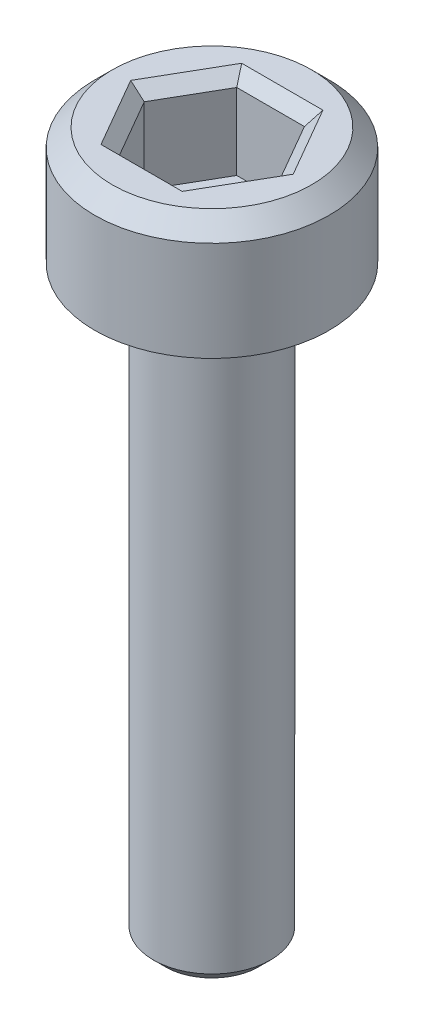
ISO-10303-21;
HEADER;
FILE_DESCRIPTION(('STEP AP214'),'2;1');
FILE_NAME('part.step','',(''),(''),'','','');
FILE_SCHEMA(('AUTOMOTIVE_DESIGN { 1 0 10303 214 1 1 1 1 }'));
ENDSEC;
DATA;
#1=APPLICATION_CONTEXT('core data for automotive mechanical design processes');
#2=APPLICATION_PROTOCOL_DEFINITION('international standard','automotive_design',2000,#1);
#3=PRODUCT_CONTEXT('',#1,'mechanical');
#4=PRODUCT('Part','Part','',(#3));
#5=PRODUCT_RELATED_PRODUCT_CATEGORY('part','',(#4));
#6=PRODUCT_DEFINITION_FORMATION('','',#4);
#7=PRODUCT_DEFINITION_CONTEXT('part definition',#1,'design');
#8=PRODUCT_DEFINITION('design','',#6,#7);
#9=PRODUCT_DEFINITION_SHAPE('','',#8);
#10=(LENGTH_UNIT() NAMED_UNIT(*) SI_UNIT(.MILLI.,.METRE.));
#11=(NAMED_UNIT(*) PLANE_ANGLE_UNIT() SI_UNIT($,.RADIAN.));
#12=(NAMED_UNIT(*) SI_UNIT($,.STERADIAN.) SOLID_ANGLE_UNIT());
#13=UNCERTAINTY_MEASURE_WITH_UNIT(LENGTH_MEASURE(1.E-05),#10,'distance_accuracy_value','');
#14=(GEOMETRIC_REPRESENTATION_CONTEXT(3) GLOBAL_UNCERTAINTY_ASSIGNED_CONTEXT((#13)) GLOBAL_UNIT_ASSIGNED_CONTEXT((#10,
#11,#12)) REPRESENTATION_CONTEXT('',''));
#15=CARTESIAN_POINT('',(0.,0.,0.));
#16=DIRECTION('',(0.,0.,1.));
#17=DIRECTION('',(1.,0.,0.));
#18=AXIS2_PLACEMENT_3D('',#15,#16,#17);
#19=CARTESIAN_POINT('',(0.,0.,0.));
#20=DIRECTION('',(0.,1.,0.));
#21=DIRECTION('',(0.,0.,1.));
#22=AXIS2_PLACEMENT_3D('',#19,#20,#21);
#23=PLANE('',#22);
#24=CARTESIAN_POINT('',(0.,0.,0.));
#25=DIRECTION('',(0.,1.,0.));
#26=DIRECTION('',(0.,0.,1.));
#27=AXIS2_PLACEMENT_3D('',#24,#25,#26);
#28=CIRCLE('',#27,2.);
#29=CARTESIAN_POINT('',(0.,0.,2.));
#30=VERTEX_POINT('',#29);
#31=EDGE_CURVE('E146',#30,#30,#28,.T.);
#32=ORIENTED_EDGE('',*,*,#31,.F.);
#33=EDGE_LOOP('',(#32));
#34=FACE_BOUND('',#33,.T.);
#35=CARTESIAN_POINT('',(0.,0.,0.));
#36=DIRECTION('',(0.,1.,0.));
#37=DIRECTION('',(0.,0.,1.));
#38=AXIS2_PLACEMENT_3D('',#35,#36,#37);
#39=CIRCLE('',#38,1.);
#40=CARTESIAN_POINT('',(0.,0.,1.));
#41=VERTEX_POINT('',#40);
#42=EDGE_CURVE('E185',#41,#41,#39,.F.);
#43=ORIENTED_EDGE('',*,*,#42,.F.);
#44=EDGE_LOOP('',(#43));
#45=FACE_BOUND('',#44,.T.);
#46=ADVANCED_FACE('F33',(#34,#45),#23,.F.);
#47=CARTESIAN_POINT('',(0.,2.,0.));
#48=DIRECTION('',(0.,-1.,0.));
#49=DIRECTION('',(0.,0.,-1.));
#50=AXIS2_PLACEMENT_3D('',#47,#48,#49);
#51=CYLINDRICAL_SURFACE('',#50,2.);
#52=CARTESIAN_POINT('',(0.,1.7,0.));
#53=DIRECTION('',(0.,1.,0.));
#54=DIRECTION('',(0.,0.,1.));
#55=AXIS2_PLACEMENT_3D('',#52,#53,#54);
#56=CIRCLE('',#55,2.);
#57=CARTESIAN_POINT('',(0.,1.7,2.));
#58=VERTEX_POINT('',#57);
#59=EDGE_CURVE('E160',#58,#58,#56,.F.);
#60=ORIENTED_EDGE('',*,*,#59,.T.);
#61=EDGE_LOOP('',(#60));
#62=FACE_BOUND('',#61,.T.);
#63=ORIENTED_EDGE('',*,*,#31,.T.);
#64=EDGE_LOOP('',(#63));
#65=FACE_BOUND('',#64,.T.);
#66=ADVANCED_FACE('F213',(#62,#65),#51,.T.);
#67=CARTESIAN_POINT('',(0.,2.,0.));
#68=DIRECTION('',(0.,1.,0.));
#69=DIRECTION('',(0.,0.,1.));
#70=AXIS2_PLACEMENT_3D('',#67,#68,#69);
#71=PLANE('',#70);
#72=DIRECTION('',(1.,0.,0.));
#73=VECTOR('',#72,1.);
#74=CARTESIAN_POINT('',(0.577350269189625,2.,-1.2));
#75=LINE('',#74,#73);
#76=CARTESIAN_POINT('',(-0.692820323027552,2.,-1.2));
#77=VERTEX_POINT('',#76);
#78=CARTESIAN_POINT('',(0.692820323027551,2.,-1.2));
#79=VERTEX_POINT('',#78);
#80=EDGE_CURVE('E165',#77,#79,#75,.T.);
#81=ORIENTED_EDGE('',*,*,#80,.T.);
#82=DIRECTION('',(0.5,0.,0.866025403784438));
#83=VECTOR('',#82,1.);
#84=CARTESIAN_POINT('',(1.32790561913614,2.,-0.100000000000001));
#85=LINE('',#84,#83);
#86=CARTESIAN_POINT('',(1.3856406460551,2.,0.));
#87=VERTEX_POINT('',#86);
#88=EDGE_CURVE('E175',#79,#87,#85,.T.);
#89=ORIENTED_EDGE('',*,*,#88,.T.);
#90=DIRECTION('',(-0.5,0.,0.866025403784439));
#91=VECTOR('',#90,1.);
#92=CARTESIAN_POINT('',(0.750555349946515,2.,1.1));
#93=LINE('',#92,#91);
#94=CARTESIAN_POINT('',(0.692820323027551,2.,1.2));
#95=VERTEX_POINT('',#94);
#96=EDGE_CURVE('E173',#87,#95,#93,.T.);
#97=ORIENTED_EDGE('',*,*,#96,.T.);
#98=DIRECTION('',(-1.,0.,0.));
#99=VECTOR('',#98,1.);
#100=CARTESIAN_POINT('',(-0.577350269189626,2.,1.2));
#101=LINE('',#100,#99);
#102=CARTESIAN_POINT('',(-0.692820323027551,2.,1.2));
#103=VERTEX_POINT('',#102);
#104=EDGE_CURVE('E171',#95,#103,#101,.T.);
#105=ORIENTED_EDGE('',*,*,#104,.T.);
#106=DIRECTION('',(-0.5,0.,-0.866025403784439));
#107=VECTOR('',#106,1.);
#108=CARTESIAN_POINT('',(-1.32790561913614,2.,0.100000000000001));
#109=LINE('',#108,#107);
#110=CARTESIAN_POINT('',(-1.3856406460551,2.,0.));
#111=VERTEX_POINT('',#110);
#112=EDGE_CURVE('E169',#103,#111,#109,.T.);
#113=ORIENTED_EDGE('',*,*,#112,.T.);
#114=DIRECTION('',(0.5,0.,-0.866025403784439));
#115=VECTOR('',#114,1.);
#116=CARTESIAN_POINT('',(-0.750555349946515,2.,-1.1));
#117=LINE('',#116,#115);
#118=EDGE_CURVE('E167',#111,#77,#117,.T.);
#119=ORIENTED_EDGE('',*,*,#118,.T.);
#120=EDGE_LOOP('',(#81,#89,#97,#105,#113,#119));
#121=FACE_BOUND('',#120,.T.);
#122=CARTESIAN_POINT('',(0.,2.,0.));
#123=DIRECTION('',(0.,1.,0.));
#124=DIRECTION('',(0.,0.,1.));
#125=AXIS2_PLACEMENT_3D('',#122,#123,#124);
#126=CIRCLE('',#125,1.7);
#127=CARTESIAN_POINT('',(0.,2.,1.7));
#128=VERTEX_POINT('',#127);
#129=EDGE_CURVE('E157',#128,#128,#126,.T.);
#130=ORIENTED_EDGE('',*,*,#129,.T.);
#131=EDGE_LOOP('',(#130));
#132=FACE_BOUND('',#131,.T.);
#133=ADVANCED_FACE('F219',(#121,#132),#71,.T.);
#134=CARTESIAN_POINT('',(0.,2.,0.));
#135=DIRECTION('',(0.,-1.,0.));
#136=DIRECTION('',(0.,0.,-1.));
#137=AXIS2_PLACEMENT_3D('',#134,#135,#136);
#138=CONICAL_SURFACE('',#137,1.7,0.785398163397447);
#139=ORIENTED_EDGE('',*,*,#59,.F.);
#140=EDGE_LOOP('',(#139));
#141=FACE_BOUND('',#140,.T.);
#142=ORIENTED_EDGE('',*,*,#129,.F.);
#143=EDGE_LOOP('',(#142));
#144=FACE_BOUND('',#143,.T.);
#145=ADVANCED_FACE('F227',(#141,#144),#138,.T.);
#146=CARTESIAN_POINT('',(0.577350269189626,0.5,1.));
#147=DIRECTION('',(0.866025403784439,0.,0.5));
#148=DIRECTION('',(0.5,0.,-0.866025403784439));
#149=AXIS2_PLACEMENT_3D('',#146,#147,#148);
#150=PLANE('',#149);
#151=DIRECTION('',(0.,1.,0.));
#152=VECTOR('',#151,1.);
#153=CARTESIAN_POINT('',(0.577350269189626,0.5,1.));
#154=LINE('',#153,#152);
#155=CARTESIAN_POINT('',(0.577350269189626,0.5,1.));
#156=VERTEX_POINT('',#155);
#157=CARTESIAN_POINT('',(0.577350269189626,1.8,1.));
#158=VERTEX_POINT('',#157);
#159=EDGE_CURVE('E144',#156,#158,#154,.T.);
#160=ORIENTED_EDGE('',*,*,#159,.T.);
#161=DIRECTION('',(0.5,0.,-0.866025403784439));
#162=VECTOR('',#161,1.);
#163=CARTESIAN_POINT('',(1.15470053837925,1.8,0.));
#164=LINE('',#163,#162);
#165=CARTESIAN_POINT('',(1.15470053837925,1.8,0.));
#166=VERTEX_POINT('',#165);
#167=EDGE_CURVE('E113',#158,#166,#164,.T.);
#168=ORIENTED_EDGE('',*,*,#167,.T.);
#169=DIRECTION('',(0.,1.,0.));
#170=VECTOR('',#169,1.);
#171=CARTESIAN_POINT('',(1.15470053837925,0.5,0.));
#172=LINE('',#171,#170);
#173=CARTESIAN_POINT('',(1.15470053837925,0.5,0.));
#174=VERTEX_POINT('',#173);
#175=EDGE_CURVE('E105',#174,#166,#172,.T.);
#176=ORIENTED_EDGE('',*,*,#175,.F.);
#177=DIRECTION('',(0.5,0.,-0.866025403784439));
#178=VECTOR('',#177,1.);
#179=CARTESIAN_POINT('',(0.577350269189626,0.5,1.));
#180=LINE('',#179,#178);
#181=EDGE_CURVE('E110',#156,#174,#180,.T.);
#182=ORIENTED_EDGE('',*,*,#181,.F.);
#183=EDGE_LOOP('',(#160,#168,#176,#182));
#184=FACE_BOUND('',#183,.T.);
#185=ADVANCED_FACE('F108',(#184),#150,.F.);
#186=CARTESIAN_POINT('',(-0.577350269189626,0.5,1.));
#187=DIRECTION('',(0.,0.,1.));
#188=DIRECTION('',(1.,0.,0.));
#189=AXIS2_PLACEMENT_3D('',#186,#187,#188);
#190=PLANE('',#189);
#191=DIRECTION('',(0.,1.,0.));
#192=VECTOR('',#191,1.);
#193=CARTESIAN_POINT('',(-0.577350269189626,0.5,1.));
#194=LINE('',#193,#192);
#195=CARTESIAN_POINT('',(-0.577350269189626,0.5,1.));
#196=VERTEX_POINT('',#195);
#197=CARTESIAN_POINT('',(-0.577350269189626,1.8,1.));
#198=VERTEX_POINT('',#197);
#199=EDGE_CURVE('E147',#196,#198,#194,.T.);
#200=ORIENTED_EDGE('',*,*,#199,.T.);
#201=DIRECTION('',(1.,0.,0.));
#202=VECTOR('',#201,1.);
#203=CARTESIAN_POINT('',(0.577350269189626,1.8,1.));
#204=LINE('',#203,#202);
#205=EDGE_CURVE('E179',#198,#158,#204,.T.);
#206=ORIENTED_EDGE('',*,*,#205,.T.);
#207=ORIENTED_EDGE('',*,*,#159,.F.);
#208=DIRECTION('',(1.,0.,0.));
#209=VECTOR('',#208,1.);
#210=CARTESIAN_POINT('',(-0.577350269189626,0.5,1.));
#211=LINE('',#210,#209);
#212=EDGE_CURVE('E118',#196,#156,#211,.T.);
#213=ORIENTED_EDGE('',*,*,#212,.F.);
#214=EDGE_LOOP('',(#200,#206,#207,#213));
#215=FACE_BOUND('',#214,.T.);
#216=ADVANCED_FACE('F280',(#215),#190,.F.);
#217=CARTESIAN_POINT('',(-1.15470053837925,0.5,0.));
#218=DIRECTION('',(-0.866025403784438,0.,0.5));
#219=DIRECTION('',(0.5,0.,0.866025403784439));
#220=AXIS2_PLACEMENT_3D('',#217,#218,#219);
#221=PLANE('',#220);
#222=DIRECTION('',(0.,1.,0.));
#223=VECTOR('',#222,1.);
#224=CARTESIAN_POINT('',(-1.15470053837925,0.5,0.));
#225=LINE('',#224,#223);
#226=CARTESIAN_POINT('',(-1.15470053837925,0.5,0.));
#227=VERTEX_POINT('',#226);
#228=CARTESIAN_POINT('',(-1.15470053837925,1.8,0.));
#229=VERTEX_POINT('',#228);
#230=EDGE_CURVE('E150',#227,#229,#225,.T.);
#231=ORIENTED_EDGE('',*,*,#230,.T.);
#232=DIRECTION('',(0.5,0.,0.866025403784439));
#233=VECTOR('',#232,1.);
#234=CARTESIAN_POINT('',(-0.577350269189626,1.8,1.));
#235=LINE('',#234,#233);
#236=EDGE_CURVE('E181',#229,#198,#235,.T.);
#237=ORIENTED_EDGE('',*,*,#236,.T.);
#238=ORIENTED_EDGE('',*,*,#199,.F.);
#239=DIRECTION('',(0.5,0.,0.866025403784439));
#240=VECTOR('',#239,1.);
#241=CARTESIAN_POINT('',(-1.15470053837925,0.5,0.));
#242=LINE('',#241,#240);
#243=EDGE_CURVE('E141',#227,#196,#242,.T.);
#244=ORIENTED_EDGE('',*,*,#243,.F.);
#245=EDGE_LOOP('',(#231,#237,#238,#244));
#246=FACE_BOUND('',#245,.T.);
#247=ADVANCED_FACE('F278',(#246),#221,.F.);
#248=CARTESIAN_POINT('',(-0.577350269189626,0.5,-1.));
#249=DIRECTION('',(-0.866025403784439,0.,-0.5));
#250=DIRECTION('',(-0.5,0.,0.866025403784439));
#251=AXIS2_PLACEMENT_3D('',#248,#249,#250);
#252=PLANE('',#251);
#253=DIRECTION('',(0.,1.,0.));
#254=VECTOR('',#253,1.);
#255=CARTESIAN_POINT('',(-0.577350269189626,0.5,-1.));
#256=LINE('',#255,#254);
#257=CARTESIAN_POINT('',(-0.577350269189626,0.5,-1.));
#258=VERTEX_POINT('',#257);
#259=CARTESIAN_POINT('',(-0.577350269189626,1.8,-1.));
#260=VERTEX_POINT('',#259);
#261=EDGE_CURVE('E152',#258,#260,#256,.T.);
#262=ORIENTED_EDGE('',*,*,#261,.T.);
#263=DIRECTION('',(-0.5,0.,0.866025403784439));
#264=VECTOR('',#263,1.);
#265=CARTESIAN_POINT('',(-1.15470053837925,1.8,0.));
#266=LINE('',#265,#264);
#267=EDGE_CURVE('E55',#260,#229,#266,.T.);
#268=ORIENTED_EDGE('',*,*,#267,.T.);
#269=ORIENTED_EDGE('',*,*,#230,.F.);
#270=DIRECTION('',(-0.5,0.,0.866025403784439));
#271=VECTOR('',#270,1.);
#272=CARTESIAN_POINT('',(-0.577350269189626,0.5,-1.));
#273=LINE('',#272,#271);
#274=EDGE_CURVE('E138',#258,#227,#273,.T.);
#275=ORIENTED_EDGE('',*,*,#274,.F.);
#276=EDGE_LOOP('',(#262,#268,#269,#275));
#277=FACE_BOUND('',#276,.T.);
#278=ADVANCED_FACE('F276',(#277),#252,.F.);
#279=CARTESIAN_POINT('',(0.577350269189625,0.5,-1.));
#280=DIRECTION('',(0.,0.,-1.));
#281=DIRECTION('',(-1.,0.,0.));
#282=AXIS2_PLACEMENT_3D('',#279,#280,#281);
#283=PLANE('',#282);
#284=DIRECTION('',(0.,1.,0.));
#285=VECTOR('',#284,1.);
#286=CARTESIAN_POINT('',(0.577350269189625,0.5,-1.));
#287=LINE('',#286,#285);
#288=CARTESIAN_POINT('',(0.577350269189625,0.5,-1.));
#289=VERTEX_POINT('',#288);
#290=CARTESIAN_POINT('',(0.577350269189625,1.8,-1.));
#291=VERTEX_POINT('',#290);
#292=EDGE_CURVE('E117',#289,#291,#287,.T.);
#293=ORIENTED_EDGE('',*,*,#292,.T.);
#294=DIRECTION('',(-1.,0.,0.));
#295=VECTOR('',#294,1.);
#296=CARTESIAN_POINT('',(-0.577350269189626,1.8,-1.));
#297=LINE('',#296,#295);
#298=EDGE_CURVE('E48',#291,#260,#297,.T.);
#299=ORIENTED_EDGE('',*,*,#298,.T.);
#300=ORIENTED_EDGE('',*,*,#261,.F.);
#301=DIRECTION('',(-1.,0.,0.));
#302=VECTOR('',#301,1.);
#303=CARTESIAN_POINT('',(0.577350269189625,0.5,-1.));
#304=LINE('',#303,#302);
#305=EDGE_CURVE('E126',#289,#258,#304,.T.);
#306=ORIENTED_EDGE('',*,*,#305,.F.);
#307=EDGE_LOOP('',(#293,#299,#300,#306));
#308=FACE_BOUND('',#307,.T.);
#309=ADVANCED_FACE('F273',(#308),#283,.F.);
#310=CARTESIAN_POINT('',(1.15470053837925,0.5,0.));
#311=DIRECTION('',(0.866025403784438,0.,-0.5));
#312=DIRECTION('',(-0.5,0.,-0.866025403784439));
#313=AXIS2_PLACEMENT_3D('',#310,#311,#312);
#314=PLANE('',#313);
#315=ORIENTED_EDGE('',*,*,#175,.T.);
#316=DIRECTION('',(-0.5,0.,-0.866025403784439));
#317=VECTOR('',#316,1.);
#318=CARTESIAN_POINT('',(0.577350269189625,1.8,-1.));
#319=LINE('',#318,#317);
#320=EDGE_CURVE('E163',#166,#291,#319,.T.);
#321=ORIENTED_EDGE('',*,*,#320,.T.);
#322=ORIENTED_EDGE('',*,*,#292,.F.);
#323=DIRECTION('',(-0.5,0.,-0.866025403784438));
#324=VECTOR('',#323,1.);
#325=CARTESIAN_POINT('',(1.15470053837925,0.5,0.));
#326=LINE('',#325,#324);
#327=EDGE_CURVE('E121',#174,#289,#326,.T.);
#328=ORIENTED_EDGE('',*,*,#327,.F.);
#329=EDGE_LOOP('',(#315,#321,#322,#328));
#330=FACE_BOUND('',#329,.T.);
#331=ADVANCED_FACE('F122',(#330),#314,.F.);
#332=CARTESIAN_POINT('',(0.,0.5,0.));
#333=DIRECTION('',(0.,1.,0.));
#334=DIRECTION('',(0.,0.,1.));
#335=AXIS2_PLACEMENT_3D('',#332,#333,#334);
#336=PLANE('',#335);
#337=ORIENTED_EDGE('',*,*,#181,.T.);
#338=ORIENTED_EDGE('',*,*,#327,.T.);
#339=ORIENTED_EDGE('',*,*,#305,.T.);
#340=ORIENTED_EDGE('',*,*,#274,.T.);
#341=ORIENTED_EDGE('',*,*,#243,.T.);
#342=ORIENTED_EDGE('',*,*,#212,.T.);
#343=EDGE_LOOP('',(#337,#338,#339,#340,#341,#342));
#344=FACE_BOUND('',#343,.T.);
#345=ADVANCED_FACE('F128',(#344),#336,.T.);
#346=CARTESIAN_POINT('',(-1.15470053837925,1.8,0.));
#347=DIRECTION('',(0.612372435695792,0.70710678118655,-0.353553390593273));
#348=DIRECTION('',(-0.5,0.,-0.866025403784439));
#349=AXIS2_PLACEMENT_3D('',#346,#347,#348);
#350=PLANE('',#349);
#351=DIRECTION('',(0.755928946018457,-0.654653670707974,0.));
#352=VECTOR('',#351,1.);
#353=CARTESIAN_POINT('',(-1.15470053837925,1.8,0.));
#354=LINE('',#353,#352);
#355=EDGE_CURVE('E134',#111,#229,#354,.T.);
#356=ORIENTED_EDGE('',*,*,#355,.F.);
#357=ORIENTED_EDGE('',*,*,#112,.F.);
#358=DIRECTION('',(0.377964473009227,-0.654653670707974,-0.654653670707981));
#359=VECTOR('',#358,1.);
#360=CARTESIAN_POINT('',(-0.577350269189626,1.8,1.));
#361=LINE('',#360,#359);
#362=EDGE_CURVE('E131',#198,#103,#361,.F.);
#363=ORIENTED_EDGE('',*,*,#362,.F.);
#364=ORIENTED_EDGE('',*,*,#236,.F.);
#365=EDGE_LOOP('',(#356,#357,#363,#364));
#366=FACE_BOUND('',#365,.T.);
#367=ADVANCED_FACE('F249',(#366),#350,.T.);
#368=CARTESIAN_POINT('',(-0.577350269189626,1.8,1.));
#369=DIRECTION('',(0.,0.707106781186551,-0.707106781186544));
#370=DIRECTION('',(-1.,0.,0.));
#371=AXIS2_PLACEMENT_3D('',#368,#369,#370);
#372=PLANE('',#371);
#373=ORIENTED_EDGE('',*,*,#362,.T.);
#374=ORIENTED_EDGE('',*,*,#104,.F.);
#375=DIRECTION('',(-0.377964473009228,-0.654653670707974,-0.654653670707981));
#376=VECTOR('',#375,1.);
#377=CARTESIAN_POINT('',(0.577350269189626,1.8,1.));
#378=LINE('',#377,#376);
#379=EDGE_CURVE('E193',#158,#95,#378,.F.);
#380=ORIENTED_EDGE('',*,*,#379,.F.);
#381=ORIENTED_EDGE('',*,*,#205,.F.);
#382=EDGE_LOOP('',(#373,#374,#380,#381));
#383=FACE_BOUND('',#382,.T.);
#384=ADVANCED_FACE('F246',(#383),#372,.T.);
#385=CARTESIAN_POINT('',(-0.577350269189626,1.8,-1.));
#386=DIRECTION('',(0.612372435695792,0.70710678118655,0.353553390593272));
#387=DIRECTION('',(0.5,0.,-0.866025403784439));
#388=AXIS2_PLACEMENT_3D('',#385,#386,#387);
#389=PLANE('',#388);
#390=ORIENTED_EDGE('',*,*,#355,.T.);
#391=ORIENTED_EDGE('',*,*,#267,.F.);
#392=DIRECTION('',(0.377964473009228,-0.654653670707974,0.65465367070798));
#393=VECTOR('',#392,1.);
#394=CARTESIAN_POINT('',(-0.577350269189626,1.8,-1.));
#395=LINE('',#394,#393);
#396=EDGE_CURVE('E190',#77,#260,#395,.T.);
#397=ORIENTED_EDGE('',*,*,#396,.F.);
#398=ORIENTED_EDGE('',*,*,#118,.F.);
#399=EDGE_LOOP('',(#390,#391,#397,#398));
#400=FACE_BOUND('',#399,.T.);
#401=ADVANCED_FACE('F242',(#400),#389,.T.);
#402=CARTESIAN_POINT('',(0.577350269189626,1.8,1.));
#403=DIRECTION('',(-0.612372435695792,0.70710678118655,-0.353553390593272));
#404=DIRECTION('',(-0.5,0.,0.866025403784439));
#405=AXIS2_PLACEMENT_3D('',#402,#403,#404);
#406=PLANE('',#405);
#407=ORIENTED_EDGE('',*,*,#379,.T.);
#408=ORIENTED_EDGE('',*,*,#96,.F.);
#409=DIRECTION('',(-0.755928946018457,-0.654653670707974,0.));
#410=VECTOR('',#409,1.);
#411=CARTESIAN_POINT('',(1.15470053837925,1.8,0.));
#412=LINE('',#411,#410);
#413=EDGE_CURVE('E188',#166,#87,#412,.F.);
#414=ORIENTED_EDGE('',*,*,#413,.F.);
#415=ORIENTED_EDGE('',*,*,#167,.F.);
#416=EDGE_LOOP('',(#407,#408,#414,#415));
#417=FACE_BOUND('',#416,.T.);
#418=ADVANCED_FACE('F238',(#417),#406,.T.);
#419=CARTESIAN_POINT('',(0.577350269189625,1.8,-1.));
#420=DIRECTION('',(0.,0.707106781186551,0.707106781186544));
#421=DIRECTION('',(1.,0.,0.));
#422=AXIS2_PLACEMENT_3D('',#419,#420,#421);
#423=PLANE('',#422);
#424=ORIENTED_EDGE('',*,*,#396,.T.);
#425=ORIENTED_EDGE('',*,*,#298,.F.);
#426=DIRECTION('',(0.377964473009229,0.654653670707974,-0.65465367070798));
#427=VECTOR('',#426,1.);
#428=CARTESIAN_POINT('',(0.41239304942116,1.51428571428571,-0.714285714285713));
#429=LINE('',#428,#427);
#430=EDGE_CURVE('E186',#79,#291,#429,.F.);
#431=ORIENTED_EDGE('',*,*,#430,.F.);
#432=ORIENTED_EDGE('',*,*,#80,.F.);
#433=EDGE_LOOP('',(#424,#425,#431,#432));
#434=FACE_BOUND('',#433,.T.);
#435=ADVANCED_FACE('F234',(#434),#423,.T.);
#436=CARTESIAN_POINT('',(1.15470053837925,1.8,0.));
#437=DIRECTION('',(-0.612372435695792,0.707106781186551,0.353553390593272));
#438=DIRECTION('',(0.5,0.,0.866025403784439));
#439=AXIS2_PLACEMENT_3D('',#436,#437,#438);
#440=PLANE('',#439);
#441=ORIENTED_EDGE('',*,*,#413,.T.);
#442=ORIENTED_EDGE('',*,*,#88,.F.);
#443=ORIENTED_EDGE('',*,*,#430,.T.);
#444=ORIENTED_EDGE('',*,*,#320,.F.);
#445=EDGE_LOOP('',(#441,#442,#443,#444));
#446=FACE_BOUND('',#445,.T.);
#447=ADVANCED_FACE('F231',(#446),#440,.T.);
#448=CARTESIAN_POINT('',(0.,-10.,0.));
#449=DIRECTION('',(0.,1.,0.));
#450=DIRECTION('',(0.,0.,1.));
#451=AXIS2_PLACEMENT_3D('',#448,#449,#450);
#452=CYLINDRICAL_SURFACE('',#451,1.);
#453=CARTESIAN_POINT('',(0.,-9.8,0.));
#454=DIRECTION('',(0.,-1.,0.));
#455=DIRECTION('',(0.,0.,-1.));
#456=AXIS2_PLACEMENT_3D('',#453,#454,#455);
#457=CIRCLE('',#456,1.);
#458=CARTESIAN_POINT('',(0.,-9.8,-1.));
#459=VERTEX_POINT('',#458);
#460=EDGE_CURVE('E11',#459,#459,#457,.F.);
#461=ORIENTED_EDGE('',*,*,#460,.T.);
#462=EDGE_LOOP('',(#461));
#463=FACE_BOUND('',#462,.T.);
#464=ORIENTED_EDGE('',*,*,#42,.T.);
#465=EDGE_LOOP('',(#464));
#466=FACE_BOUND('',#465,.T.);
#467=ADVANCED_FACE('F209',(#463,#466),#452,.T.);
#468=CARTESIAN_POINT('',(0.,-10.,0.));
#469=DIRECTION('',(0.,-1.,0.));
#470=DIRECTION('',(0.,0.,-1.));
#471=AXIS2_PLACEMENT_3D('',#468,#469,#470);
#472=PLANE('',#471);
#473=CARTESIAN_POINT('',(0.,-10.,0.));
#474=DIRECTION('',(0.,-1.,0.));
#475=DIRECTION('',(0.,0.,-1.));
#476=AXIS2_PLACEMENT_3D('',#473,#474,#475);
#477=CIRCLE('',#476,0.799999999999999);
#478=CARTESIAN_POINT('',(0.,-10.,-0.799999999999999));
#479=VERTEX_POINT('',#478);
#480=EDGE_CURVE('E41',#479,#479,#477,.T.);
#481=ORIENTED_EDGE('',*,*,#480,.T.);
#482=EDGE_LOOP('',(#481));
#483=FACE_BOUND('',#482,.T.);
#484=ADVANCED_FACE('F202',(#483),#472,.T.);
#485=CARTESIAN_POINT('',(0.,-10.,0.));
#486=DIRECTION('',(0.,1.,0.));
#487=DIRECTION('',(0.,0.,1.));
#488=AXIS2_PLACEMENT_3D('',#485,#486,#487);
#489=CONICAL_SURFACE('',#488,0.799999999999999,0.785398163397446);
#490=ORIENTED_EDGE('',*,*,#460,.F.);
#491=EDGE_LOOP('',(#490));
#492=FACE_BOUND('',#491,.T.);
#493=ORIENTED_EDGE('',*,*,#480,.F.);
#494=EDGE_LOOP('',(#493));
#495=FACE_BOUND('',#494,.T.);
#496=ADVANCED_FACE('F35',(#492,#495),#489,.T.);
#497=CLOSED_SHELL('',(#46,#66,#133,#145,#185,#216,#247,#278,#309,#331,#345,#367,#384,#401,#418,
#435,#447,#467,#484,#496));
#498=MANIFOLD_SOLID_BREP('B2',#497);
#499=ADVANCED_BREP_SHAPE_REPRESENTATION('',(#18,#498),#14);
#500=SHAPE_DEFINITION_REPRESENTATION(#9,#499);
ENDSEC;
END-ISO-10303-21;
